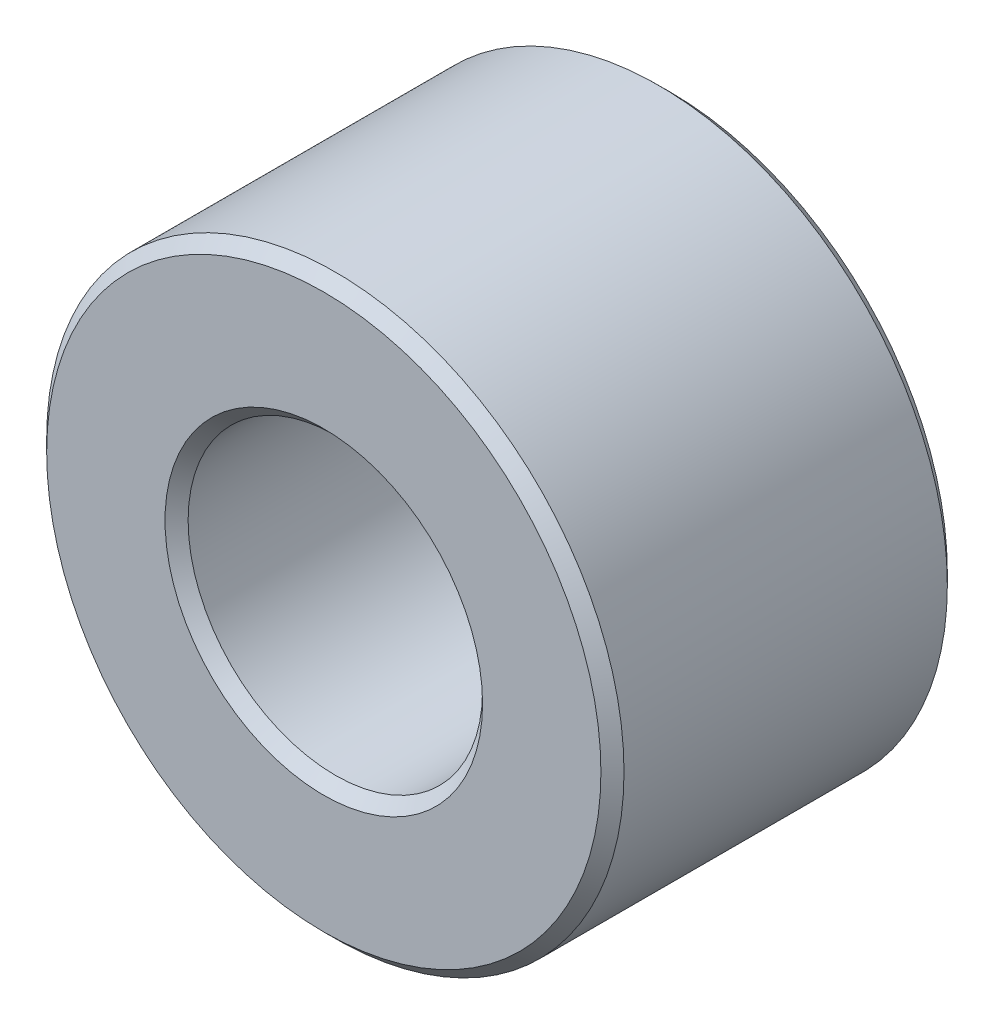
ISO-10303-21;
HEADER;
FILE_DESCRIPTION(('STEP AP214'),'2;1');
FILE_NAME('part.step','',(''),(''),'','','');
FILE_SCHEMA(('AUTOMOTIVE_DESIGN { 1 0 10303 214 1 1 1 1 }'));
ENDSEC;
DATA;
#1=APPLICATION_CONTEXT('core data for automotive mechanical design processes');
#2=APPLICATION_PROTOCOL_DEFINITION('international standard','automotive_design',2000,#1);
#3=PRODUCT_CONTEXT('',#1,'mechanical');
#4=PRODUCT('Part','Part','',(#3));
#5=PRODUCT_RELATED_PRODUCT_CATEGORY('part','',(#4));
#6=PRODUCT_DEFINITION_FORMATION('','',#4);
#7=PRODUCT_DEFINITION_CONTEXT('part definition',#1,'design');
#8=PRODUCT_DEFINITION('design','',#6,#7);
#9=PRODUCT_DEFINITION_SHAPE('','',#8);
#10=(LENGTH_UNIT() NAMED_UNIT(*) SI_UNIT(.MILLI.,.METRE.));
#11=(NAMED_UNIT(*) PLANE_ANGLE_UNIT() SI_UNIT($,.RADIAN.));
#12=(NAMED_UNIT(*) SI_UNIT($,.STERADIAN.) SOLID_ANGLE_UNIT());
#13=UNCERTAINTY_MEASURE_WITH_UNIT(LENGTH_MEASURE(1.E-05),#10,'distance_accuracy_value','');
#14=(GEOMETRIC_REPRESENTATION_CONTEXT(3) GLOBAL_UNCERTAINTY_ASSIGNED_CONTEXT((#13)) GLOBAL_UNIT_ASSIGNED_CONTEXT((#10,
#11,#12)) REPRESENTATION_CONTEXT('',''));
#15=CARTESIAN_POINT('',(0.,0.,0.));
#16=DIRECTION('',(0.,0.,1.));
#17=DIRECTION('',(1.,0.,0.));
#18=AXIS2_PLACEMENT_3D('',#15,#16,#17);
#19=CARTESIAN_POINT('',(0.,0.,6.));
#20=DIRECTION('',(0.,0.,1.));
#21=DIRECTION('',(1.,0.,0.));
#22=AXIS2_PLACEMENT_3D('',#19,#20,#21);
#23=PLANE('',#22);
#24=CARTESIAN_POINT('',(0.,0.,6.));
#25=DIRECTION('',(0.,0.,1.));
#26=DIRECTION('',(1.,0.,0.));
#27=AXIS2_PLACEMENT_3D('',#24,#25,#26);
#28=CIRCLE('',#27,2.75);
#29=CARTESIAN_POINT('',(2.75,0.,6.));
#30=VERTEX_POINT('',#29);
#31=EDGE_CURVE('E10',#30,#30,#28,.F.);
#32=ORIENTED_EDGE('',*,*,#31,.T.);
#33=EDGE_LOOP('',(#32));
#34=FACE_BOUND('',#33,.T.);
#35=CARTESIAN_POINT('',(0.,0.,6.));
#36=DIRECTION('',(0.,0.,1.));
#37=DIRECTION('',(1.,0.,0.));
#38=AXIS2_PLACEMENT_3D('',#35,#36,#37);
#39=CIRCLE('',#38,4.8);
#40=CARTESIAN_POINT('',(4.8,0.,6.));
#41=VERTEX_POINT('',#40);
#42=EDGE_CURVE('E41',#41,#41,#39,.T.);
#43=ORIENTED_EDGE('',*,*,#42,.T.);
#44=EDGE_LOOP('',(#43));
#45=FACE_BOUND('',#44,.T.);
#46=ADVANCED_FACE('F34',(#34,#45),#23,.T.);
#47=CARTESIAN_POINT('',(0.,0.,0.));
#48=DIRECTION('',(0.,0.,1.));
#49=DIRECTION('',(1.,0.,0.));
#50=AXIS2_PLACEMENT_3D('',#47,#48,#49);
#51=PLANE('',#50);
#52=CARTESIAN_POINT('',(0.,0.,0.));
#53=DIRECTION('',(0.,0.,1.));
#54=DIRECTION('',(1.,0.,0.));
#55=AXIS2_PLACEMENT_3D('',#52,#53,#54);
#56=CIRCLE('',#55,4.8);
#57=CARTESIAN_POINT('',(4.8,0.,0.));
#58=VERTEX_POINT('',#57);
#59=EDGE_CURVE('E54',#58,#58,#56,.F.);
#60=ORIENTED_EDGE('',*,*,#59,.T.);
#61=EDGE_LOOP('',(#60));
#62=FACE_BOUND('',#61,.T.);
#63=CARTESIAN_POINT('',(0.,0.,0.));
#64=DIRECTION('',(0.,0.,1.));
#65=DIRECTION('',(1.,0.,0.));
#66=AXIS2_PLACEMENT_3D('',#63,#64,#65);
#67=CIRCLE('',#66,2.75);
#68=CARTESIAN_POINT('',(2.75,0.,0.));
#69=VERTEX_POINT('',#68);
#70=EDGE_CURVE('E57',#69,#69,#67,.T.);
#71=ORIENTED_EDGE('',*,*,#70,.T.);
#72=EDGE_LOOP('',(#71));
#73=FACE_BOUND('',#72,.T.);
#74=ADVANCED_FACE('F78',(#62,#73),#51,.F.);
#75=CARTESIAN_POINT('',(0.,0.,6.));
#76=DIRECTION('',(0.,0.,-1.));
#77=DIRECTION('',(-1.,0.,0.));
#78=AXIS2_PLACEMENT_3D('',#75,#76,#77);
#79=CYLINDRICAL_SURFACE('',#78,5.);
#80=CARTESIAN_POINT('',(0.,0.,0.199999999999998));
#81=DIRECTION('',(0.,0.,1.));
#82=DIRECTION('',(1.,0.,0.));
#83=AXIS2_PLACEMENT_3D('',#80,#81,#82);
#84=CIRCLE('',#83,5.);
#85=CARTESIAN_POINT('',(5.,0.,0.199999999999998));
#86=VERTEX_POINT('',#85);
#87=EDGE_CURVE('E60',#86,#86,#84,.T.);
#88=ORIENTED_EDGE('',*,*,#87,.T.);
#89=EDGE_LOOP('',(#88));
#90=FACE_BOUND('',#89,.T.);
#91=CARTESIAN_POINT('',(0.,0.,5.8));
#92=DIRECTION('',(0.,0.,1.));
#93=DIRECTION('',(1.,0.,0.));
#94=AXIS2_PLACEMENT_3D('',#91,#92,#93);
#95=CIRCLE('',#94,5.);
#96=CARTESIAN_POINT('',(5.,0.,5.8));
#97=VERTEX_POINT('',#96);
#98=EDGE_CURVE('E63',#97,#97,#95,.F.);
#99=ORIENTED_EDGE('',*,*,#98,.T.);
#100=EDGE_LOOP('',(#99));
#101=FACE_BOUND('',#100,.T.);
#102=ADVANCED_FACE('F67',(#90,#101),#79,.T.);
#103=CARTESIAN_POINT('',(0.,0.,6.));
#104=DIRECTION('',(0.,0.,-1.));
#105=DIRECTION('',(-1.,0.,0.));
#106=AXIS2_PLACEMENT_3D('',#103,#104,#105);
#107=CYLINDRICAL_SURFACE('',#106,2.55);
#108=CARTESIAN_POINT('',(0.,0.,0.200000000000003));
#109=DIRECTION('',(0.,0.,1.));
#110=DIRECTION('',(1.,0.,0.));
#111=AXIS2_PLACEMENT_3D('',#108,#109,#110);
#112=CIRCLE('',#111,2.55);
#113=CARTESIAN_POINT('',(2.55,0.,0.200000000000003));
#114=VERTEX_POINT('',#113);
#115=EDGE_CURVE('E45',#114,#114,#112,.F.);
#116=ORIENTED_EDGE('',*,*,#115,.T.);
#117=EDGE_LOOP('',(#116));
#118=FACE_BOUND('',#117,.T.);
#119=CARTESIAN_POINT('',(0.,0.,5.8));
#120=DIRECTION('',(0.,0.,1.));
#121=DIRECTION('',(1.,0.,0.));
#122=AXIS2_PLACEMENT_3D('',#119,#120,#121);
#123=CIRCLE('',#122,2.55);
#124=CARTESIAN_POINT('',(2.55,0.,5.8));
#125=VERTEX_POINT('',#124);
#126=EDGE_CURVE('E49',#125,#125,#123,.T.);
#127=ORIENTED_EDGE('',*,*,#126,.T.);
#128=EDGE_LOOP('',(#127));
#129=FACE_BOUND('',#128,.T.);
#130=ADVANCED_FACE('F86',(#118,#129),#107,.F.);
#131=CARTESIAN_POINT('',(0.,0.,0.199999999999998));
#132=DIRECTION('',(0.,0.,1.));
#133=DIRECTION('',(1.,0.,0.));
#134=AXIS2_PLACEMENT_3D('',#131,#132,#133);
#135=CONICAL_SURFACE('',#134,5.,0.785398163397455);
#136=ORIENTED_EDGE('',*,*,#59,.F.);
#137=EDGE_LOOP('',(#136));
#138=FACE_BOUND('',#137,.T.);
#139=ORIENTED_EDGE('',*,*,#87,.F.);
#140=EDGE_LOOP('',(#139));
#141=FACE_BOUND('',#140,.T.);
#142=ADVANCED_FACE('F91',(#138,#141),#135,.T.);
#143=CARTESIAN_POINT('',(0.,0.,0.));
#144=DIRECTION('',(0.,0.,-1.));
#145=DIRECTION('',(-1.,0.,0.));
#146=AXIS2_PLACEMENT_3D('',#143,#144,#145);
#147=CONICAL_SURFACE('',#146,2.75,0.785398163397443);
#148=ORIENTED_EDGE('',*,*,#115,.F.);
#149=EDGE_LOOP('',(#148));
#150=FACE_BOUND('',#149,.T.);
#151=ORIENTED_EDGE('',*,*,#70,.F.);
#152=EDGE_LOOP('',(#151));
#153=FACE_BOUND('',#152,.T.);
#154=ADVANCED_FACE('F75',(#150,#153),#147,.F.);
#155=CARTESIAN_POINT('',(0.,0.,5.8));
#156=DIRECTION('',(0.,0.,1.));
#157=DIRECTION('',(1.,0.,0.));
#158=AXIS2_PLACEMENT_3D('',#155,#156,#157);
#159=CONICAL_SURFACE('',#158,2.55,0.785398163397454);
#160=ORIENTED_EDGE('',*,*,#31,.F.);
#161=EDGE_LOOP('',(#160));
#162=FACE_BOUND('',#161,.T.);
#163=ORIENTED_EDGE('',*,*,#126,.F.);
#164=EDGE_LOOP('',(#163));
#165=FACE_BOUND('',#164,.T.);
#166=ADVANCED_FACE('F71',(#162,#165),#159,.F.);
#167=CARTESIAN_POINT('',(0.,0.,6.));
#168=DIRECTION('',(0.,0.,-1.));
#169=DIRECTION('',(-1.,0.,0.));
#170=AXIS2_PLACEMENT_3D('',#167,#168,#169);
#171=CONICAL_SURFACE('',#170,4.8,0.785398163397448);
#172=ORIENTED_EDGE('',*,*,#98,.F.);
#173=EDGE_LOOP('',(#172));
#174=FACE_BOUND('',#173,.T.);
#175=ORIENTED_EDGE('',*,*,#42,.F.);
#176=EDGE_LOOP('',(#175));
#177=FACE_BOUND('',#176,.T.);
#178=ADVANCED_FACE('F36',(#174,#177),#171,.T.);
#179=CLOSED_SHELL('',(#46,#74,#102,#130,#142,#154,#166,#178));
#180=MANIFOLD_SOLID_BREP('B2',#179);
#181=ADVANCED_BREP_SHAPE_REPRESENTATION('',(#18,#180),#14);
#182=SHAPE_DEFINITION_REPRESENTATION(#9,#181);
ENDSEC;
END-ISO-10303-21;
